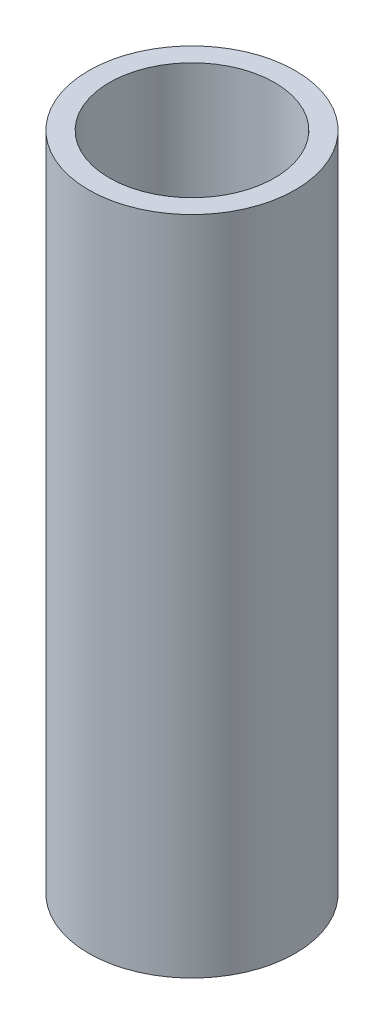
ISO-10303-21;
HEADER;
FILE_DESCRIPTION(('STEP AP214'),'2;1');
FILE_NAME('part.step','',(''),(''),'','','');
FILE_SCHEMA(('AUTOMOTIVE_DESIGN { 1 0 10303 214 1 1 1 1 }'));
ENDSEC;
DATA;
#1=APPLICATION_CONTEXT('core data for automotive mechanical design processes');
#2=APPLICATION_PROTOCOL_DEFINITION('international standard','automotive_design',2000,#1);
#3=PRODUCT_CONTEXT('',#1,'mechanical');
#4=PRODUCT('Part','Part','',(#3));
#5=PRODUCT_RELATED_PRODUCT_CATEGORY('part','',(#4));
#6=PRODUCT_DEFINITION_FORMATION('','',#4);
#7=PRODUCT_DEFINITION_CONTEXT('part definition',#1,'design');
#8=PRODUCT_DEFINITION('design','',#6,#7);
#9=PRODUCT_DEFINITION_SHAPE('','',#8);
#10=(LENGTH_UNIT() NAMED_UNIT(*) SI_UNIT(.MILLI.,.METRE.));
#11=(NAMED_UNIT(*) PLANE_ANGLE_UNIT() SI_UNIT($,.RADIAN.));
#12=(NAMED_UNIT(*) SI_UNIT($,.STERADIAN.) SOLID_ANGLE_UNIT());
#13=UNCERTAINTY_MEASURE_WITH_UNIT(LENGTH_MEASURE(1.E-05),#10,'distance_accuracy_value','');
#14=(GEOMETRIC_REPRESENTATION_CONTEXT(3) GLOBAL_UNCERTAINTY_ASSIGNED_CONTEXT((#13)) GLOBAL_UNIT_ASSIGNED_CONTEXT((#10,
#11,#12)) REPRESENTATION_CONTEXT('',''));
#15=CARTESIAN_POINT('',(0.,0.,0.));
#16=DIRECTION('',(0.,0.,1.));
#17=DIRECTION('',(1.,0.,0.));
#18=AXIS2_PLACEMENT_3D('',#15,#16,#17);
#19=CARTESIAN_POINT('',(0.,16.,0.));
#20=DIRECTION('',(0.,1.,0.));
#21=DIRECTION('',(0.,0.,1.));
#22=AXIS2_PLACEMENT_3D('',#19,#20,#21);
#23=PLANE('',#22);
#24=CARTESIAN_POINT('',(0.,16.,0.));
#25=DIRECTION('',(0.,1.,0.));
#26=DIRECTION('',(0.,0.,1.));
#27=AXIS2_PLACEMENT_3D('',#24,#25,#26);
#28=CIRCLE('',#27,2.5);
#29=CARTESIAN_POINT('',(0.,16.,2.5));
#30=VERTEX_POINT('',#29);
#31=EDGE_CURVE('E10',#30,#30,#28,.T.);
#32=ORIENTED_EDGE('',*,*,#31,.T.);
#33=EDGE_LOOP('',(#32));
#34=FACE_BOUND('',#33,.T.);
#35=CARTESIAN_POINT('',(0.,16.,0.));
#36=DIRECTION('',(0.,1.,0.));
#37=DIRECTION('',(0.,0.,1.));
#38=AXIS2_PLACEMENT_3D('',#35,#36,#37);
#39=CIRCLE('',#38,2.);
#40=CARTESIAN_POINT('',(0.,16.,2.));
#41=VERTEX_POINT('',#40);
#42=EDGE_CURVE('E46',#41,#41,#39,.T.);
#43=ORIENTED_EDGE('',*,*,#42,.F.);
#44=EDGE_LOOP('',(#43));
#45=FACE_BOUND('',#44,.T.);
#46=ADVANCED_FACE('F35',(#34,#45),#23,.T.);
#47=CARTESIAN_POINT('',(0.,0.,0.));
#48=DIRECTION('',(0.,1.,0.));
#49=DIRECTION('',(0.,0.,1.));
#50=AXIS2_PLACEMENT_3D('',#47,#48,#49);
#51=PLANE('',#50);
#52=CARTESIAN_POINT('',(0.,0.,0.));
#53=DIRECTION('',(0.,1.,0.));
#54=DIRECTION('',(0.,0.,1.));
#55=AXIS2_PLACEMENT_3D('',#52,#53,#54);
#56=CIRCLE('',#55,2.5);
#57=CARTESIAN_POINT('',(0.,0.,2.5));
#58=VERTEX_POINT('',#57);
#59=EDGE_CURVE('E39',#58,#58,#56,.T.);
#60=ORIENTED_EDGE('',*,*,#59,.F.);
#61=EDGE_LOOP('',(#60));
#62=FACE_BOUND('',#61,.T.);
#63=CARTESIAN_POINT('',(0.,0.,0.));
#64=DIRECTION('',(0.,1.,0.));
#65=DIRECTION('',(0.,0.,1.));
#66=AXIS2_PLACEMENT_3D('',#63,#64,#65);
#67=CIRCLE('',#66,2.);
#68=CARTESIAN_POINT('',(0.,0.,2.));
#69=VERTEX_POINT('',#68);
#70=EDGE_CURVE('E48',#69,#69,#67,.T.);
#71=ORIENTED_EDGE('',*,*,#70,.T.);
#72=EDGE_LOOP('',(#71));
#73=FACE_BOUND('',#72,.T.);
#74=ADVANCED_FACE('F58',(#62,#73),#51,.F.);
#75=CARTESIAN_POINT('',(0.,16.,0.));
#76=DIRECTION('',(0.,-1.,0.));
#77=DIRECTION('',(0.,0.,-1.));
#78=AXIS2_PLACEMENT_3D('',#75,#76,#77);
#79=CYLINDRICAL_SURFACE('',#78,2.5);
#80=ORIENTED_EDGE('',*,*,#31,.F.);
#81=EDGE_LOOP('',(#80));
#82=FACE_BOUND('',#81,.T.);
#83=ORIENTED_EDGE('',*,*,#59,.T.);
#84=EDGE_LOOP('',(#83));
#85=FACE_BOUND('',#84,.T.);
#86=ADVANCED_FACE('F37',(#82,#85),#79,.T.);
#87=CARTESIAN_POINT('',(0.,16.,0.));
#88=DIRECTION('',(0.,-1.,0.));
#89=DIRECTION('',(0.,0.,-1.));
#90=AXIS2_PLACEMENT_3D('',#87,#88,#89);
#91=CYLINDRICAL_SURFACE('',#90,2.);
#92=ORIENTED_EDGE('',*,*,#42,.T.);
#93=EDGE_LOOP('',(#92));
#94=FACE_BOUND('',#93,.T.);
#95=ORIENTED_EDGE('',*,*,#70,.F.);
#96=EDGE_LOOP('',(#95));
#97=FACE_BOUND('',#96,.T.);
#98=ADVANCED_FACE('F54',(#94,#97),#91,.F.);
#99=CLOSED_SHELL('',(#46,#74,#86,#98));
#100=MANIFOLD_SOLID_BREP('B2',#99);
#101=ADVANCED_BREP_SHAPE_REPRESENTATION('',(#18,#100),#14);
#102=SHAPE_DEFINITION_REPRESENTATION(#9,#101);
ENDSEC;
END-ISO-10303-21;
